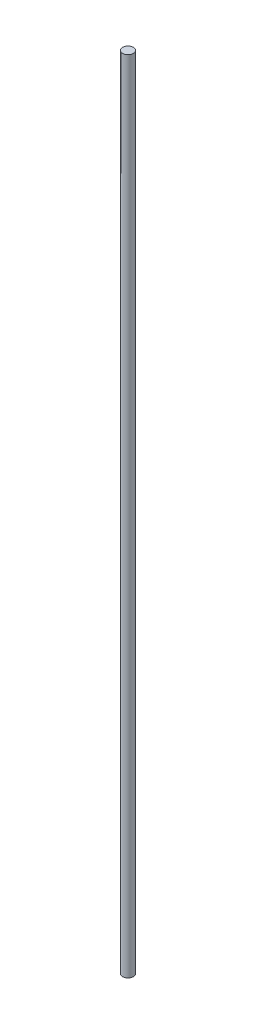
ISO-10303-21;
HEADER;
FILE_DESCRIPTION(('STEP AP214'),'2;1');
FILE_NAME('part.step','',(''),(''),'','','');
FILE_SCHEMA(('AUTOMOTIVE_DESIGN { 1 0 10303 214 1 1 1 1 }'));
ENDSEC;
DATA;
#1=APPLICATION_CONTEXT('core data for automotive mechanical design processes');
#2=APPLICATION_PROTOCOL_DEFINITION('international standard','automotive_design',2000,#1);
#3=PRODUCT_CONTEXT('',#1,'mechanical');
#4=PRODUCT('Part','Part','',(#3));
#5=PRODUCT_RELATED_PRODUCT_CATEGORY('part','',(#4));
#6=PRODUCT_DEFINITION_FORMATION('','',#4);
#7=PRODUCT_DEFINITION_CONTEXT('part definition',#1,'design');
#8=PRODUCT_DEFINITION('design','',#6,#7);
#9=PRODUCT_DEFINITION_SHAPE('','',#8);
#10=(LENGTH_UNIT() NAMED_UNIT(*) SI_UNIT(.MILLI.,.METRE.));
#11=(NAMED_UNIT(*) PLANE_ANGLE_UNIT() SI_UNIT($,.RADIAN.));
#12=(NAMED_UNIT(*) SI_UNIT($,.STERADIAN.) SOLID_ANGLE_UNIT());
#13=UNCERTAINTY_MEASURE_WITH_UNIT(LENGTH_MEASURE(1.E-05),#10,'distance_accuracy_value','');
#14=(GEOMETRIC_REPRESENTATION_CONTEXT(3) GLOBAL_UNCERTAINTY_ASSIGNED_CONTEXT((#13)) GLOBAL_UNIT_ASSIGNED_CONTEXT((#10,
#11,#12)) REPRESENTATION_CONTEXT('',''));
#15=CARTESIAN_POINT('',(0.,0.,0.));
#16=DIRECTION('',(0.,0.,1.));
#17=DIRECTION('',(1.,0.,0.));
#18=AXIS2_PLACEMENT_3D('',#15,#16,#17);
#19=CARTESIAN_POINT('',(0.,600.,0.));
#20=DIRECTION('',(0.,-1.,0.));
#21=DIRECTION('',(0.,0.,-1.));
#22=AXIS2_PLACEMENT_3D('',#19,#20,#21);
#23=CYLINDRICAL_SURFACE('',#22,4.);
#24=CARTESIAN_POINT('',(0.,600.,0.));
#25=DIRECTION('',(0.,1.,0.));
#26=DIRECTION('',(0.,0.,1.));
#27=AXIS2_PLACEMENT_3D('',#24,#25,#26);
#28=CIRCLE('',#27,4.);
#29=CARTESIAN_POINT('',(0.,600.,4.));
#30=VERTEX_POINT('',#29);
#31=EDGE_CURVE('E10',#30,#30,#28,.T.);
#32=ORIENTED_EDGE('',*,*,#31,.F.);
#33=EDGE_LOOP('',(#32));
#34=FACE_BOUND('',#33,.T.);
#35=CARTESIAN_POINT('',(0.,0.,0.));
#36=DIRECTION('',(0.,1.,0.));
#37=DIRECTION('',(0.,0.,1.));
#38=AXIS2_PLACEMENT_3D('',#35,#36,#37);
#39=CIRCLE('',#38,4.);
#40=CARTESIAN_POINT('',(0.,0.,4.));
#41=VERTEX_POINT('',#40);
#42=EDGE_CURVE('E41',#41,#41,#39,.T.);
#43=ORIENTED_EDGE('',*,*,#42,.T.);
#44=EDGE_LOOP('',(#43));
#45=FACE_BOUND('',#44,.T.);
#46=ADVANCED_FACE('F38',(#34,#45),#23,.T.);
#47=CARTESIAN_POINT('',(0.,600.,0.));
#48=DIRECTION('',(0.,1.,0.));
#49=DIRECTION('',(0.,0.,1.));
#50=AXIS2_PLACEMENT_3D('',#47,#48,#49);
#51=PLANE('',#50);
#52=ORIENTED_EDGE('',*,*,#31,.T.);
#53=EDGE_LOOP('',(#52));
#54=FACE_BOUND('',#53,.T.);
#55=ADVANCED_FACE('F54',(#54),#51,.T.);
#56=CARTESIAN_POINT('',(0.,0.,0.));
#57=DIRECTION('',(0.,1.,0.));
#58=DIRECTION('',(0.,0.,1.));
#59=AXIS2_PLACEMENT_3D('',#56,#57,#58);
#60=PLANE('',#59);
#61=ORIENTED_EDGE('',*,*,#42,.F.);
#62=EDGE_LOOP('',(#61));
#63=FACE_BOUND('',#62,.T.);
#64=ADVANCED_FACE('F52',(#63),#60,.F.);
#65=CLOSED_SHELL('',(#46,#55,#64));
#66=MANIFOLD_SOLID_BREP('B2',#65);
#67=ADVANCED_BREP_SHAPE_REPRESENTATION('',(#18,#66),#14);
#68=SHAPE_DEFINITION_REPRESENTATION(#9,#67);
ENDSEC;
END-ISO-10303-21;
